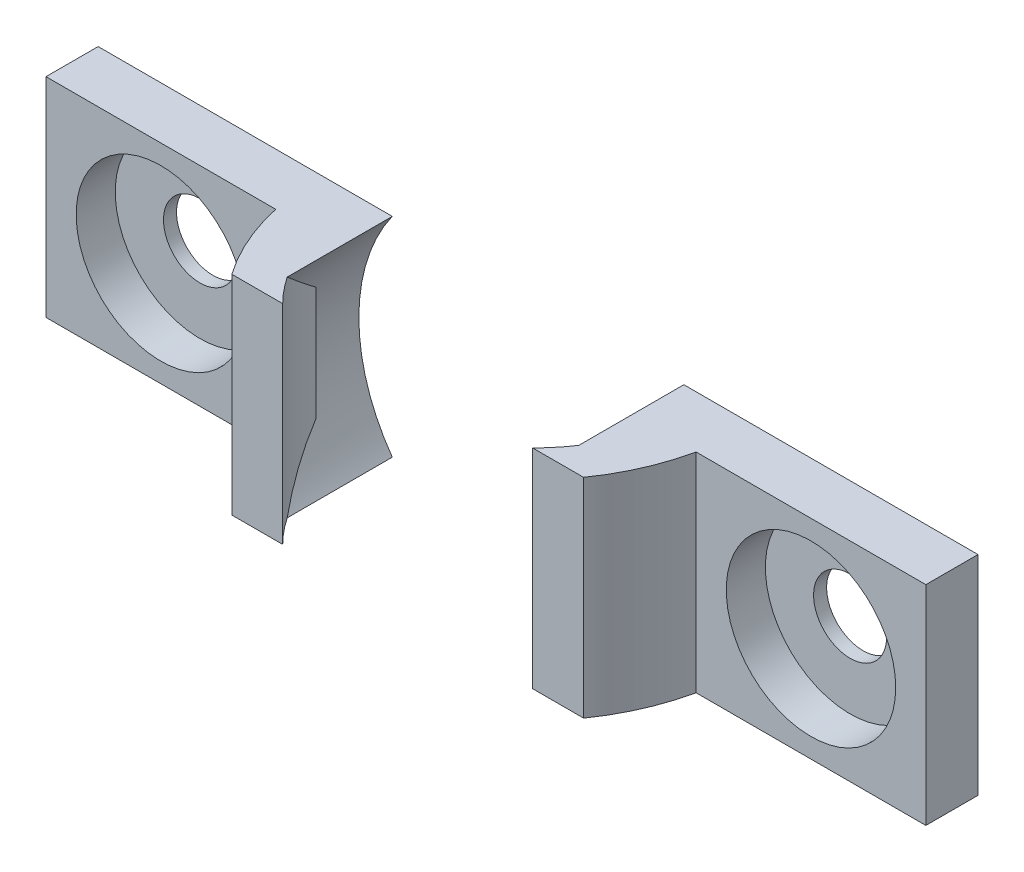
ISO-10303-21;
HEADER;
FILE_DESCRIPTION(('STEP AP214'),'2;1');
FILE_NAME('part.step','',(''),(''),'','','');
FILE_SCHEMA(('AUTOMOTIVE_DESIGN { 1 0 10303 214 1 1 1 1 }'));
ENDSEC;
DATA;
#1=APPLICATION_CONTEXT('core data for automotive mechanical design processes');
#2=APPLICATION_PROTOCOL_DEFINITION('international standard','automotive_design',2000,#1);
#3=PRODUCT_CONTEXT('',#1,'mechanical');
#4=PRODUCT('Part','Part','',(#3));
#5=PRODUCT_RELATED_PRODUCT_CATEGORY('part','',(#4));
#6=PRODUCT_DEFINITION_FORMATION('','',#4);
#7=PRODUCT_DEFINITION_CONTEXT('part definition',#1,'design');
#8=PRODUCT_DEFINITION('design','',#6,#7);
#9=PRODUCT_DEFINITION_SHAPE('','',#8);
#10=(LENGTH_UNIT() NAMED_UNIT(*) SI_UNIT(.MILLI.,.METRE.));
#11=(NAMED_UNIT(*) PLANE_ANGLE_UNIT() SI_UNIT($,.RADIAN.));
#12=(NAMED_UNIT(*) SI_UNIT($,.STERADIAN.) SOLID_ANGLE_UNIT());
#13=UNCERTAINTY_MEASURE_WITH_UNIT(LENGTH_MEASURE(1.E-05),#10,'distance_accuracy_value','');
#14=(GEOMETRIC_REPRESENTATION_CONTEXT(3) GLOBAL_UNCERTAINTY_ASSIGNED_CONTEXT((#13)) GLOBAL_UNIT_ASSIGNED_CONTEXT((#10,
#11,#12)) REPRESENTATION_CONTEXT('',''));
#15=CARTESIAN_POINT('',(0.,0.,0.));
#16=DIRECTION('',(0.,0.,1.));
#17=DIRECTION('',(1.,0.,0.));
#18=AXIS2_PLACEMENT_3D('',#15,#16,#17);
#19=CARTESIAN_POINT('',(-52.019276555044,41.9944163464974,0.250000000000002));
#20=DIRECTION('',(0.,1.,0.));
#21=DIRECTION('',(0.,0.,1.));
#22=AXIS2_PLACEMENT_3D('',#19,#20,#21);
#23=CYLINDRICAL_SURFACE('',#22,6.75);
#24=DIRECTION('',(0.,1.,0.));
#25=VECTOR('',#24,1.);
#26=CARTESIAN_POINT('',(-45.5000741498414,41.9944163464974,2.));
#27=LINE('',#26,#25);
#28=CARTESIAN_POINT('',(-45.5000741498414,43.8113851969259,2.));
#29=VERTEX_POINT('',#28);
#30=CARTESIAN_POINT('',(-45.5000741498414,48.1774474960689,2.));
#31=VERTEX_POINT('',#30);
#32=EDGE_CURVE('E110',#29,#31,#27,.T.);
#33=ORIENTED_EDGE('',*,*,#32,.F.);
#34=CARTESIAN_POINT('',(-46.4277092434578,41.9944163464974,4.03112086556359));
#35=CARTESIAN_POINT('',(-46.3745450771389,42.0687361568406,3.95249636870452));
#36=CARTESIAN_POINT('',(-46.3232633654575,42.1435523845356,3.87309234133147));
#37=CARTESIAN_POINT('',(-46.2243968698751,42.2939969111948,3.71276547153426));
#38=CARTESIAN_POINT('',(-46.1768120889218,42.3696252108065,3.63184262789907));
#39=CARTESIAN_POINT('',(-46.0398947307384,42.5968040836876,3.38755839376506));
#40=CARTESIAN_POINT('',(-45.9559434440079,42.7492906120617,3.2220047005269));
#41=CARTESIAN_POINT('',(-45.8405585930417,42.9783939429114,2.96928504371106));
#42=CARTESIAN_POINT('',(-45.8038517045878,43.0548295451782,2.88430730286349));
#43=CARTESIAN_POINT('',(-45.7339084787982,43.2075141521692,2.71276795793608));
#44=CARTESIAN_POINT('',(-45.7006720041256,43.2837631641607,2.62620641669231));
#45=CARTESIAN_POINT('',(-45.6375101932743,43.436001426688,2.45097382625512));
#46=CARTESIAN_POINT('',(-45.6075992508396,43.5119882660473,2.36229548239488));
#47=CARTESIAN_POINT('',(-45.5512398600187,43.6627539304358,2.18282099136035));
#48=CARTESIAN_POINT('',(-45.5247918071639,43.7375326166161,2.0920246036561));
#49=CARTESIAN_POINT('',(-45.5000741498414,43.8113851969259,2.));
#50=B_SPLINE_CURVE_WITH_KNOTS('',3,(#34,#35,#36,#37,#38,#39,#40,#41,#42,#43,#44,#45,#46,#47,#48,
#49),.UNSPECIFIED.,.F.,.F.,(4,2,2,2,2,2,2,4),(0.,0.361594811071268,0.72318991046974,
1.44327185995061,1.80336518182789,2.16344424812011,2.52502568207447,2.88664837989668),.UNSPECIFIED.);
#51=CARTESIAN_POINT('',(-46.4277092434578,41.9944163464974,4.03112086556359));
#52=VERTEX_POINT('',#51);
#53=EDGE_CURVE('E114',#52,#29,#50,.T.);
#54=ORIENTED_EDGE('',*,*,#53,.F.);
#55=CARTESIAN_POINT('',(-52.019276555044,41.9944163464974,0.250000000000002));
#56=DIRECTION('',(0.,-1.,0.));
#57=DIRECTION('',(0.,0.,-1.));
#58=AXIS2_PLACEMENT_3D('',#55,#56,#57);
#59=CIRCLE('',#58,6.75);
#60=CARTESIAN_POINT('',(-47.2234450317313,41.9944163464974,5.));
#61=VERTEX_POINT('',#60);
#62=EDGE_CURVE('E173',#52,#61,#59,.T.);
#63=ORIENTED_EDGE('',*,*,#62,.T.);
#64=DIRECTION('',(0.,1.,0.));
#65=VECTOR('',#64,1.);
#66=CARTESIAN_POINT('',(-47.2234450317313,41.9944163464974,5.));
#67=LINE('',#66,#65);
#68=CARTESIAN_POINT('',(-47.2234450317313,49.9944163464974,5.));
#69=VERTEX_POINT('',#68);
#70=EDGE_CURVE('E180',#61,#69,#67,.T.);
#71=ORIENTED_EDGE('',*,*,#70,.T.);
#72=CARTESIAN_POINT('',(-52.019276555044,49.9944163464974,0.250000000000002));
#73=DIRECTION('',(0.,-1.,0.));
#74=DIRECTION('',(0.,0.,-1.));
#75=AXIS2_PLACEMENT_3D('',#72,#73,#74);
#76=CIRCLE('',#75,6.75);
#77=CARTESIAN_POINT('',(-46.4277092434578,49.9944163464974,4.03112086556359));
#78=VERTEX_POINT('',#77);
#79=EDGE_CURVE('E112',#78,#69,#76,.T.);
#80=ORIENTED_EDGE('',*,*,#79,.F.);
#81=CARTESIAN_POINT('',(-45.5000741498414,48.1774474960689,2.));
#82=CARTESIAN_POINT('',(-45.5247918071639,48.2513000763787,2.0920246036561));
#83=CARTESIAN_POINT('',(-45.5512398600187,48.326078762559,2.18282099136035));
#84=CARTESIAN_POINT('',(-45.6075992508396,48.4768444269474,2.36229548239488));
#85=CARTESIAN_POINT('',(-45.6375101932743,48.5528312663067,2.45097382625512));
#86=CARTESIAN_POINT('',(-45.7006720041256,48.705069528834,2.62620641669231));
#87=CARTESIAN_POINT('',(-45.7339084787982,48.7813185408256,2.71276795793608));
#88=CARTESIAN_POINT('',(-45.8038517045878,48.9340031478166,2.88430730286349));
#89=CARTESIAN_POINT('',(-45.8405585930417,49.0104387500834,2.96928504371106));
#90=CARTESIAN_POINT('',(-45.9559434440079,49.239542080933,3.2220047005269));
#91=CARTESIAN_POINT('',(-46.0398947307384,49.3920286093072,3.38755839376505));
#92=CARTESIAN_POINT('',(-46.1768120889218,49.6192074821883,3.63184262789907));
#93=CARTESIAN_POINT('',(-46.2243968698751,49.6948357818,3.71276547153425));
#94=CARTESIAN_POINT('',(-46.3232633654575,49.8452803084592,3.87309234133146));
#95=CARTESIAN_POINT('',(-46.3745450771389,49.9200965361541,3.95249636870451));
#96=CARTESIAN_POINT('',(-46.4277092434578,49.9944163464975,4.03112086556355));
#97=B_SPLINE_CURVE_WITH_KNOTS('',3,(#81,#82,#83,#84,#85,#86,#87,#88,#89,#90,#91,#92,#93,#94,#95,
#96),.UNSPECIFIED.,.F.,.F.,(4,2,2,2,2,2,2,4),(0.,0.361622697822208,0.723204131776575,
1.08328319806879,1.44337651994607,2.16345846942693,2.52505356882539,2.88664837989668),.UNSPECIFIED.);
#98=EDGE_CURVE('E108',#31,#78,#97,.T.);
#99=ORIENTED_EDGE('',*,*,#98,.F.);
#100=EDGE_LOOP('',(#33,#54,#63,#71,#80,#99));
#101=FACE_BOUND('',#100,.T.);
#102=ADVANCED_FACE('F44',(#101),#23,.F.);
#103=CARTESIAN_POINT('',(-52.0192765550441,45.9944163464974,2.));
#104=DIRECTION('',(0.,0.,-1.));
#105=DIRECTION('',(-1.,0.,0.));
#106=AXIS2_PLACEMENT_3D('',#103,#104,#105);
#107=CYLINDRICAL_SURFACE('',#106,6.875);
#108=CARTESIAN_POINT('',(-52.0192765550441,45.9944163464974,0.));
#109=DIRECTION('',(0.,0.,1.));
#110=DIRECTION('',(1.,0.,0.));
#111=AXIS2_PLACEMENT_3D('',#108,#109,#110);
#112=CIRCLE('',#111,6.875);
#113=CARTESIAN_POINT('',(-46.4277092434578,41.9944163464974,0.));
#114=VERTEX_POINT('',#113);
#115=CARTESIAN_POINT('',(-46.4277092434578,49.9944163464974,0.));
#116=VERTEX_POINT('',#115);
#117=EDGE_CURVE('E119',#114,#116,#112,.T.);
#118=ORIENTED_EDGE('',*,*,#117,.F.);
#119=DIRECTION('',(0.,0.,-1.));
#120=VECTOR('',#119,1.);
#121=CARTESIAN_POINT('',(-46.4277092434578,41.9944163464974,2.));
#122=LINE('',#121,#120);
#123=EDGE_CURVE('E12',#52,#114,#122,.T.);
#124=ORIENTED_EDGE('',*,*,#123,.F.);
#125=ORIENTED_EDGE('',*,*,#53,.T.);
#126=CARTESIAN_POINT('',(-52.0192765550441,45.9944163464974,2.));
#127=DIRECTION('',(0.,0.,1.));
#128=DIRECTION('',(1.,0.,0.));
#129=AXIS2_PLACEMENT_3D('',#126,#127,#128);
#130=CIRCLE('',#129,6.875);
#131=EDGE_CURVE('E118',#29,#31,#130,.T.);
#132=ORIENTED_EDGE('',*,*,#131,.T.);
#133=ORIENTED_EDGE('',*,*,#98,.T.);
#134=DIRECTION('',(0.,0.,-1.));
#135=VECTOR('',#134,1.);
#136=CARTESIAN_POINT('',(-46.4277092434578,49.9944163464974,2.));
#137=LINE('',#136,#135);
#138=EDGE_CURVE('E65',#78,#116,#137,.T.);
#139=ORIENTED_EDGE('',*,*,#138,.T.);
#140=EDGE_LOOP('',(#118,#124,#125,#132,#133,#139));
#141=FACE_BOUND('',#140,.T.);
#142=ADVANCED_FACE('F46',(#141),#107,.F.);
#143=CARTESIAN_POINT('',(0.,41.9944163464974,2.));
#144=DIRECTION('',(0.,1.,0.));
#145=DIRECTION('',(-1.,0.,0.));
#146=AXIS2_PLACEMENT_3D('',#143,#144,#145);
#147=PLANE('',#146);
#148=ORIENTED_EDGE('',*,*,#62,.F.);
#149=ORIENTED_EDGE('',*,*,#123,.T.);
#150=DIRECTION('',(1.,0.,0.));
#151=VECTOR('',#150,1.);
#152=CARTESIAN_POINT('',(0.,41.9944163464974,0.));
#153=LINE('',#152,#151);
#154=CARTESIAN_POINT('',(-35.1442765550441,41.9944163464974,0.));
#155=VERTEX_POINT('',#154);
#156=EDGE_CURVE('E137',#114,#155,#153,.T.);
#157=ORIENTED_EDGE('',*,*,#156,.T.);
#158=DIRECTION('',(0.,0.,-1.));
#159=VECTOR('',#158,1.);
#160=CARTESIAN_POINT('',(-35.1442765550441,41.9944163464974,2.));
#161=LINE('',#160,#159);
#162=CARTESIAN_POINT('',(-35.1442765550441,41.9944163464974,2.));
#163=VERTEX_POINT('',#162);
#164=EDGE_CURVE('E52',#163,#155,#161,.T.);
#165=ORIENTED_EDGE('',*,*,#164,.F.);
#166=DIRECTION('',(1.,0.,0.));
#167=VECTOR('',#166,1.);
#168=CARTESIAN_POINT('',(0.,41.9944163464974,2.));
#169=LINE('',#168,#167);
#170=CARTESIAN_POINT('',(-43.9570188067455,41.9944163464974,2.));
#171=VERTEX_POINT('',#170);
#172=EDGE_CURVE('E122',#171,#163,#169,.T.);
#173=ORIENTED_EDGE('',*,*,#172,.F.);
#174=CARTESIAN_POINT('',(-52.019276555044,41.9944163464974,0.250000000000002));
#175=DIRECTION('',(0.,-1.,0.));
#176=DIRECTION('',(0.,0.,-1.));
#177=AXIS2_PLACEMENT_3D('',#174,#175,#176);
#178=CIRCLE('',#177,8.25);
#179=CARTESIAN_POINT('',(-45.273907773428,41.9944163464974,5.));
#180=VERTEX_POINT('',#179);
#181=EDGE_CURVE('E167',#171,#180,#178,.T.);
#182=ORIENTED_EDGE('',*,*,#181,.T.);
#183=DIRECTION('',(-1.,0.,0.));
#184=VECTOR('',#183,1.);
#185=CARTESIAN_POINT('',(0.,41.9944163464974,5.00000000000002));
#186=LINE('',#185,#184);
#187=EDGE_CURVE('E170',#180,#61,#186,.T.);
#188=ORIENTED_EDGE('',*,*,#187,.T.);
#189=EDGE_LOOP('',(#148,#149,#157,#165,#173,#182,#188));
#190=FACE_BOUND('',#189,.T.);
#191=ADVANCED_FACE('F165',(#190),#147,.F.);
#192=CARTESIAN_POINT('',(-35.1442765550441,0.,2.));
#193=DIRECTION('',(-1.,0.,0.));
#194=DIRECTION('',(0.,0.,1.));
#195=AXIS2_PLACEMENT_3D('',#192,#193,#194);
#196=PLANE('',#195);
#197=DIRECTION('',(0.,1.,0.));
#198=VECTOR('',#197,1.);
#199=CARTESIAN_POINT('',(-35.1442765550441,0.,0.));
#200=LINE('',#199,#198);
#201=CARTESIAN_POINT('',(-35.1442765550441,49.9944163464974,0.));
#202=VERTEX_POINT('',#201);
#203=EDGE_CURVE('E127',#155,#202,#200,.T.);
#204=ORIENTED_EDGE('',*,*,#203,.T.);
#205=DIRECTION('',(0.,0.,-1.));
#206=VECTOR('',#205,1.);
#207=CARTESIAN_POINT('',(-35.1442765550441,49.9944163464974,2.));
#208=LINE('',#207,#206);
#209=CARTESIAN_POINT('',(-35.1442765550441,49.9944163464974,2.));
#210=VERTEX_POINT('',#209);
#211=EDGE_CURVE('E141',#210,#202,#208,.T.);
#212=ORIENTED_EDGE('',*,*,#211,.F.);
#213=DIRECTION('',(0.,1.,0.));
#214=VECTOR('',#213,1.);
#215=CARTESIAN_POINT('',(-35.1442765550441,0.,2.));
#216=LINE('',#215,#214);
#217=EDGE_CURVE('E125',#163,#210,#216,.T.);
#218=ORIENTED_EDGE('',*,*,#217,.F.);
#219=ORIENTED_EDGE('',*,*,#164,.T.);
#220=EDGE_LOOP('',(#204,#212,#218,#219));
#221=FACE_BOUND('',#220,.T.);
#222=ADVANCED_FACE('F148',(#221),#196,.F.);
#223=CARTESIAN_POINT('',(0.,49.9944163464974,2.));
#224=DIRECTION('',(0.,-1.,0.));
#225=DIRECTION('',(1.,0.,0.));
#226=AXIS2_PLACEMENT_3D('',#223,#224,#225);
#227=PLANE('',#226);
#228=ORIENTED_EDGE('',*,*,#138,.F.);
#229=ORIENTED_EDGE('',*,*,#79,.T.);
#230=DIRECTION('',(-1.,0.,0.));
#231=VECTOR('',#230,1.);
#232=CARTESIAN_POINT('',(0.,49.9944163464974,5.00000000000002));
#233=LINE('',#232,#231);
#234=CARTESIAN_POINT('',(-45.273907773428,49.9944163464974,5.));
#235=VERTEX_POINT('',#234);
#236=EDGE_CURVE('E189',#235,#69,#233,.T.);
#237=ORIENTED_EDGE('',*,*,#236,.F.);
#238=CARTESIAN_POINT('',(-52.019276555044,49.9944163464974,0.250000000000002));
#239=DIRECTION('',(0.,-1.,0.));
#240=DIRECTION('',(0.,0.,-1.));
#241=AXIS2_PLACEMENT_3D('',#238,#239,#240);
#242=CIRCLE('',#241,8.25);
#243=CARTESIAN_POINT('',(-43.9570188067455,49.9944163464974,2.));
#244=VERTEX_POINT('',#243);
#245=EDGE_CURVE('E160',#244,#235,#242,.T.);
#246=ORIENTED_EDGE('',*,*,#245,.F.);
#247=DIRECTION('',(-1.,0.,0.));
#248=VECTOR('',#247,1.);
#249=CARTESIAN_POINT('',(0.,49.9944163464974,2.));
#250=LINE('',#249,#248);
#251=EDGE_CURVE('E132',#210,#244,#250,.T.);
#252=ORIENTED_EDGE('',*,*,#251,.F.);
#253=ORIENTED_EDGE('',*,*,#211,.T.);
#254=DIRECTION('',(-1.,0.,0.));
#255=VECTOR('',#254,1.);
#256=CARTESIAN_POINT('',(0.,49.9944163464974,0.));
#257=LINE('',#256,#255);
#258=EDGE_CURVE('E123',#202,#116,#257,.T.);
#259=ORIENTED_EDGE('',*,*,#258,.T.);
#260=EDGE_LOOP('',(#228,#229,#237,#246,#252,#253,#259));
#261=FACE_BOUND('',#260,.T.);
#262=ADVANCED_FACE('F156',(#261),#227,.F.);
#263=CARTESIAN_POINT('',(0.,0.,2.));
#264=DIRECTION('',(0.,0.,1.));
#265=DIRECTION('',(1.,0.,0.));
#266=AXIS2_PLACEMENT_3D('',#263,#264,#265);
#267=PLANE('',#266);
#268=CARTESIAN_POINT('',(-39.5506476808948,45.9944163464974,2.));
#269=DIRECTION('',(0.,0.,1.));
#270=DIRECTION('',(1.,0.,0.));
#271=AXIS2_PLACEMENT_3D('',#268,#269,#270);
#272=CIRCLE('',#271,3.25);
#273=CARTESIAN_POINT('',(-36.3006476808948,45.9944163464974,2.));
#274=VERTEX_POINT('',#273);
#275=EDGE_CURVE('E333',#274,#274,#272,.T.);
#276=ORIENTED_EDGE('',*,*,#275,.F.);
#277=EDGE_LOOP('',(#276));
#278=FACE_BOUND('',#277,.T.);
#279=DIRECTION('',(0.,1.,0.));
#280=VECTOR('',#279,1.);
#281=CARTESIAN_POINT('',(-43.9570188067455,41.9944163464974,2.));
#282=LINE('',#281,#280);
#283=EDGE_CURVE('E120',#171,#244,#282,.T.);
#284=ORIENTED_EDGE('',*,*,#283,.F.);
#285=ORIENTED_EDGE('',*,*,#172,.T.);
#286=ORIENTED_EDGE('',*,*,#217,.T.);
#287=ORIENTED_EDGE('',*,*,#251,.T.);
#288=EDGE_LOOP('',(#284,#285,#286,#287));
#289=FACE_BOUND('',#288,.T.);
#290=ADVANCED_FACE('F163',(#278,#289),#267,.T.);
#291=CARTESIAN_POINT('',(0.,0.,0.));
#292=DIRECTION('',(0.,0.,1.));
#293=DIRECTION('',(1.,0.,0.));
#294=AXIS2_PLACEMENT_3D('',#291,#292,#293);
#295=PLANE('',#294);
#296=CARTESIAN_POINT('',(-39.5506476808948,45.9944163464974,0.));
#297=DIRECTION('',(0.,0.,1.));
#298=DIRECTION('',(1.,0.,0.));
#299=AXIS2_PLACEMENT_3D('',#296,#297,#298);
#300=CIRCLE('',#299,1.4);
#301=CARTESIAN_POINT('',(-38.1506476808948,45.9944163464974,0.));
#302=VERTEX_POINT('',#301);
#303=EDGE_CURVE('E332',#302,#302,#300,.F.);
#304=ORIENTED_EDGE('',*,*,#303,.F.);
#305=EDGE_LOOP('',(#304));
#306=FACE_BOUND('',#305,.T.);
#307=ORIENTED_EDGE('',*,*,#117,.T.);
#308=ORIENTED_EDGE('',*,*,#258,.F.);
#309=ORIENTED_EDGE('',*,*,#203,.F.);
#310=ORIENTED_EDGE('',*,*,#156,.F.);
#311=EDGE_LOOP('',(#307,#308,#309,#310));
#312=FACE_BOUND('',#311,.T.);
#313=ADVANCED_FACE('F155',(#306,#312),#295,.F.);
#314=CARTESIAN_POINT('',(0.,41.9944163464974,2.00000000000001));
#315=DIRECTION('',(0.,0.,-1.));
#316=DIRECTION('',(-1.,0.,0.));
#317=AXIS2_PLACEMENT_3D('',#314,#315,#316);
#318=PLANE('',#317);
#319=ORIENTED_EDGE('',*,*,#131,.F.);
#320=ORIENTED_EDGE('',*,*,#32,.T.);
#321=EDGE_LOOP('',(#319,#320));
#322=FACE_BOUND('',#321,.T.);
#323=ADVANCED_FACE('F117',(#322),#318,.T.);
#324=CARTESIAN_POINT('',(-52.019276555044,41.9944163464974,0.250000000000002));
#325=DIRECTION('',(0.,1.,0.));
#326=DIRECTION('',(0.,0.,1.));
#327=AXIS2_PLACEMENT_3D('',#324,#325,#326);
#328=CYLINDRICAL_SURFACE('',#327,8.25);
#329=ORIENTED_EDGE('',*,*,#245,.T.);
#330=DIRECTION('',(0.,1.,0.));
#331=VECTOR('',#330,1.);
#332=CARTESIAN_POINT('',(-45.273907773428,41.9944163464974,5.));
#333=LINE('',#332,#331);
#334=EDGE_CURVE('E176',#180,#235,#333,.T.);
#335=ORIENTED_EDGE('',*,*,#334,.F.);
#336=ORIENTED_EDGE('',*,*,#181,.F.);
#337=ORIENTED_EDGE('',*,*,#283,.T.);
#338=EDGE_LOOP('',(#329,#335,#336,#337));
#339=FACE_BOUND('',#338,.T.);
#340=ADVANCED_FACE('F177',(#339),#328,.T.);
#341=CARTESIAN_POINT('',(0.,41.9944163464974,5.00000000000002));
#342=DIRECTION('',(0.,0.,-1.));
#343=DIRECTION('',(-1.,0.,0.));
#344=AXIS2_PLACEMENT_3D('',#341,#342,#343);
#345=PLANE('',#344);
#346=ORIENTED_EDGE('',*,*,#236,.T.);
#347=ORIENTED_EDGE('',*,*,#70,.F.);
#348=ORIENTED_EDGE('',*,*,#187,.F.);
#349=ORIENTED_EDGE('',*,*,#334,.T.);
#350=EDGE_LOOP('',(#346,#347,#348,#349));
#351=FACE_BOUND('',#350,.T.);
#352=ADVANCED_FACE('F182',(#351),#345,.F.);
#353=CARTESIAN_POINT('',(-39.5506476808948,45.9944163464974,0.5));
#354=DIRECTION('',(0.,0.,1.));
#355=DIRECTION('',(1.,0.,0.));
#356=AXIS2_PLACEMENT_3D('',#353,#354,#355);
#357=CYLINDRICAL_SURFACE('',#356,3.25);
#358=CARTESIAN_POINT('',(-39.5506476808948,45.9944163464974,0.5));
#359=DIRECTION('',(0.,0.,1.));
#360=DIRECTION('',(1.,0.,0.));
#361=AXIS2_PLACEMENT_3D('',#358,#359,#360);
#362=CIRCLE('',#361,3.25);
#363=CARTESIAN_POINT('',(-36.3006476808948,45.9944163464974,0.5));
#364=VERTEX_POINT('',#363);
#365=EDGE_CURVE('E336',#364,#364,#362,.T.);
#366=ORIENTED_EDGE('',*,*,#365,.F.);
#367=EDGE_LOOP('',(#366));
#368=FACE_BOUND('',#367,.T.);
#369=ORIENTED_EDGE('',*,*,#275,.T.);
#370=EDGE_LOOP('',(#369));
#371=FACE_BOUND('',#370,.T.);
#372=ADVANCED_FACE('F209',(#368,#371),#357,.F.);
#373=CARTESIAN_POINT('',(-39.5506476808948,45.9944163464974,0.5));
#374=DIRECTION('',(0.,0.,1.));
#375=DIRECTION('',(1.,0.,0.));
#376=AXIS2_PLACEMENT_3D('',#373,#374,#375);
#377=PLANE('',#376);
#378=CARTESIAN_POINT('',(-39.5506476808948,45.9944163464974,0.5));
#379=DIRECTION('',(0.,0.,1.));
#380=DIRECTION('',(1.,0.,0.));
#381=AXIS2_PLACEMENT_3D('',#378,#379,#380);
#382=CIRCLE('',#381,1.4);
#383=CARTESIAN_POINT('',(-38.1506476808948,45.9944163464974,0.5));
#384=VERTEX_POINT('',#383);
#385=EDGE_CURVE('E329',#384,#384,#382,.T.);
#386=ORIENTED_EDGE('',*,*,#385,.F.);
#387=EDGE_LOOP('',(#386));
#388=FACE_BOUND('',#387,.T.);
#389=ORIENTED_EDGE('',*,*,#365,.T.);
#390=EDGE_LOOP('',(#389));
#391=FACE_BOUND('',#390,.T.);
#392=ADVANCED_FACE('F302',(#388,#391),#377,.T.);
#393=CARTESIAN_POINT('',(-39.5506476808948,45.9944163464974,-0.00100000000000002));
#394=DIRECTION('',(0.,0.,1.));
#395=DIRECTION('',(1.,0.,0.));
#396=AXIS2_PLACEMENT_3D('',#393,#394,#395);
#397=CYLINDRICAL_SURFACE('',#396,1.4);
#398=ORIENTED_EDGE('',*,*,#385,.T.);
#399=EDGE_LOOP('',(#398));
#400=FACE_BOUND('',#399,.T.);
#401=ORIENTED_EDGE('',*,*,#303,.T.);
#402=EDGE_LOOP('',(#401));
#403=FACE_BOUND('',#402,.T.);
#404=ADVANCED_FACE('F310',(#400,#403),#397,.F.);
#405=CLOSED_SHELL('',(#102,#142,#191,#222,#262,#290,#313,#323,#340,#352,#372,#392,#404));
#406=MANIFOLD_SOLID_BREP('B2',#405);
#407=CARTESIAN_POINT('',(-52.019276555044,41.9944163464974,0.250000000000002));
#408=DIRECTION('',(0.,1.,0.));
#409=DIRECTION('',(0.,0.,1.));
#410=AXIS2_PLACEMENT_3D('',#407,#408,#409);
#411=CYLINDRICAL_SURFACE('',#410,6.75);
#412=CARTESIAN_POINT('',(-52.019276555044,41.9944163464974,0.250000000000002));
#413=DIRECTION('',(0.,-1.,0.));
#414=DIRECTION('',(0.,0.,-1.));
#415=AXIS2_PLACEMENT_3D('',#412,#413,#414);
#416=CIRCLE('',#415,6.75);
#417=CARTESIAN_POINT('',(-56.8151080783567,41.9944163464974,5.));
#418=VERTEX_POINT('',#417);
#419=CARTESIAN_POINT('',(-57.6108438666303,41.9944163464974,4.03112086556351));
#420=VERTEX_POINT('',#419);
#421=EDGE_CURVE('E425',#418,#420,#416,.T.);
#422=ORIENTED_EDGE('',*,*,#421,.T.);
#423=CARTESIAN_POINT('',(-58.5384789602467,43.8113851969257,2.));
#424=CARTESIAN_POINT('',(-58.5137613029242,43.7375326166159,2.09202460365609));
#425=CARTESIAN_POINT('',(-58.4873132500693,43.6627539304356,2.18282099136034));
#426=CARTESIAN_POINT('',(-58.4309538592485,43.5119882660472,2.36229548239487));
#427=CARTESIAN_POINT('',(-58.4010429168137,43.4360014266879,2.4509738262551));
#428=CARTESIAN_POINT('',(-58.3378811059624,43.2837631641606,2.62620641669229));
#429=CARTESIAN_POINT('',(-58.3046446312899,43.2075141521691,2.71276795793605));
#430=CARTESIAN_POINT('',(-58.2347014055002,43.0548295451781,2.88430730286345));
#431=CARTESIAN_POINT('',(-58.1979945170464,42.9783939429113,2.96928504371102));
#432=CARTESIAN_POINT('',(-58.0826096660802,42.7492906120617,3.22200470052685));
#433=CARTESIAN_POINT('',(-57.9986583793497,42.5968040836875,3.38755839376499));
#434=CARTESIAN_POINT('',(-57.8617410211662,42.3696252108064,3.631842627899));
#435=CARTESIAN_POINT('',(-57.814156240213,42.2939969111948,3.71276547153418));
#436=CARTESIAN_POINT('',(-57.7152897446306,42.1435523845356,3.87309234133138));
#437=CARTESIAN_POINT('',(-57.6640080329492,42.0687361568406,3.95249636870442));
#438=CARTESIAN_POINT('',(-57.6108438666303,41.9944163464973,4.03112086556346));
#439=B_SPLINE_CURVE_WITH_KNOTS('',3,(#423,#424,#425,#426,#427,#428,#429,#430,#431,#432,#433,
#434,#435,#436,#437,#438),.UNSPECIFIED.,.F.,.F.,(4,2,2,2,2,2,2,4),(0.,0.361622697822184,
0.723204131776527,1.08328319806871,1.44337651994597,2.16345846942679,2.52505356882524,
2.88664837989648),.UNSPECIFIED.);
#440=CARTESIAN_POINT('',(-58.5384789602467,43.8113851969257,2.));
#441=VERTEX_POINT('',#440);
#442=EDGE_CURVE('E434',#441,#420,#439,.T.);
#443=ORIENTED_EDGE('',*,*,#442,.F.);
#444=DIRECTION('',(0.,1.,0.));
#445=VECTOR('',#444,1.);
#446=CARTESIAN_POINT('',(-58.5384789602467,41.9944163464974,2.));
#447=LINE('',#446,#445);
#448=CARTESIAN_POINT('',(-58.5384789602467,48.1774474960691,2.));
#449=VERTEX_POINT('',#448);
#450=EDGE_CURVE('E460',#441,#449,#447,.T.);
#451=ORIENTED_EDGE('',*,*,#450,.T.);
#452=CARTESIAN_POINT('',(-57.6108438666303,49.9944163464974,4.03112086556351));
#453=CARTESIAN_POINT('',(-57.6640080329492,49.9200965361541,3.95249636870444));
#454=CARTESIAN_POINT('',(-57.7152897446305,49.8452803084592,3.8730923413314));
#455=CARTESIAN_POINT('',(-57.814156240213,49.6948357818,3.71276547153419));
#456=CARTESIAN_POINT('',(-57.8617410211662,49.6192074821883,3.63184262789901));
#457=CARTESIAN_POINT('',(-57.9986583793497,49.3920286093073,3.387558393765));
#458=CARTESIAN_POINT('',(-58.0826096660802,49.2395420809331,3.22200470052686));
#459=CARTESIAN_POINT('',(-58.1979945170464,49.0104387500835,2.96928504371102));
#460=CARTESIAN_POINT('',(-58.2347014055002,48.9340031478167,2.88430730286346));
#461=CARTESIAN_POINT('',(-58.3046446312899,48.7813185408257,2.71276795793606));
#462=CARTESIAN_POINT('',(-58.3378811059624,48.7050695288342,2.6262064166923));
#463=CARTESIAN_POINT('',(-58.4010429168137,48.5528312663069,2.45097382625511));
#464=CARTESIAN_POINT('',(-58.4309538592485,48.4768444269476,2.36229548239487));
#465=CARTESIAN_POINT('',(-58.4873132500693,48.3260787625591,2.18282099136034));
#466=CARTESIAN_POINT('',(-58.5137613029242,48.2513000763788,2.09202460365609));
#467=CARTESIAN_POINT('',(-58.5384789602467,48.1774474960691,2.));
#468=B_SPLINE_CURVE_WITH_KNOTS('',3,(#452,#453,#454,#455,#456,#457,#458,#459,#460,#461,#462,
#463,#464,#465,#466,#467),.UNSPECIFIED.,.F.,.F.,(4,2,2,2,2,2,2,4),(0.,0.361594811071247,
0.7231899104697,1.44327185995052,1.80336518182776,2.16344424811996,2.52502568207431,
2.8866483798965),.UNSPECIFIED.);
#469=CARTESIAN_POINT('',(-57.6108438666303,49.9944163464974,4.03112086556351));
#470=VERTEX_POINT('',#469);
#471=EDGE_CURVE('E440',#470,#449,#468,.T.);
#472=ORIENTED_EDGE('',*,*,#471,.F.);
#473=CARTESIAN_POINT('',(-52.019276555044,49.9944163464974,0.250000000000002));
#474=DIRECTION('',(0.,-1.,0.));
#475=DIRECTION('',(0.,0.,-1.));
#476=AXIS2_PLACEMENT_3D('',#473,#474,#475);
#477=CIRCLE('',#476,6.75);
#478=CARTESIAN_POINT('',(-56.8151080783567,49.9944163464974,5.));
#479=VERTEX_POINT('',#478);
#480=EDGE_CURVE('E461',#479,#470,#477,.T.);
#481=ORIENTED_EDGE('',*,*,#480,.F.);
#482=DIRECTION('',(0.,1.,0.));
#483=VECTOR('',#482,1.);
#484=CARTESIAN_POINT('',(-56.8151080783567,41.9944163464974,5.));
#485=LINE('',#484,#483);
#486=EDGE_CURVE('E444',#418,#479,#485,.T.);
#487=ORIENTED_EDGE('',*,*,#486,.F.);
#488=EDGE_LOOP('',(#422,#443,#451,#472,#481,#487));
#489=FACE_BOUND('',#488,.T.);
#490=ADVANCED_FACE('F356',(#489),#411,.F.);
#491=CARTESIAN_POINT('',(0.,0.,2.));
#492=DIRECTION('',(0.,0.,1.));
#493=DIRECTION('',(1.,0.,0.));
#494=AXIS2_PLACEMENT_3D('',#491,#492,#493);
#495=PLANE('',#494);
#496=CARTESIAN_POINT('',(-64.4879054291933,45.9944163464974,2.));
#497=DIRECTION('',(0.,0.,1.));
#498=DIRECTION('',(1.,0.,0.));
#499=AXIS2_PLACEMENT_3D('',#496,#497,#498);
#500=CIRCLE('',#499,3.25);
#501=CARTESIAN_POINT('',(-61.2379054291933,45.9944163464974,2.));
#502=VERTEX_POINT('',#501);
#503=EDGE_CURVE('E540',#502,#502,#500,.T.);
#504=ORIENTED_EDGE('',*,*,#503,.F.);
#505=EDGE_LOOP('',(#504));
#506=FACE_BOUND('',#505,.T.);
#507=DIRECTION('',(-1.,0.,0.));
#508=VECTOR('',#507,1.);
#509=CARTESIAN_POINT('',(0.,41.9944163464974,2.));
#510=LINE('',#509,#508);
#511=CARTESIAN_POINT('',(-60.0815343033426,41.9944163464974,2.));
#512=VERTEX_POINT('',#511);
#513=CARTESIAN_POINT('',(-68.894276555044,41.9944163464974,2.));
#514=VERTEX_POINT('',#513);
#515=EDGE_CURVE('E431',#512,#514,#510,.T.);
#516=ORIENTED_EDGE('',*,*,#515,.F.);
#517=DIRECTION('',(0.,1.,0.));
#518=VECTOR('',#517,1.);
#519=CARTESIAN_POINT('',(-60.0815343033426,41.9944163464974,2.));
#520=LINE('',#519,#518);
#521=CARTESIAN_POINT('',(-60.0815343033426,49.9944163464974,2.));
#522=VERTEX_POINT('',#521);
#523=EDGE_CURVE('E467',#512,#522,#520,.T.);
#524=ORIENTED_EDGE('',*,*,#523,.T.);
#525=DIRECTION('',(1.,0.,0.));
#526=VECTOR('',#525,1.);
#527=CARTESIAN_POINT('',(0.,49.9944163464974,2.));
#528=LINE('',#527,#526);
#529=CARTESIAN_POINT('',(-68.894276555044,49.9944163464974,2.));
#530=VERTEX_POINT('',#529);
#531=EDGE_CURVE('E474',#530,#522,#528,.T.);
#532=ORIENTED_EDGE('',*,*,#531,.F.);
#533=DIRECTION('',(0.,1.,0.));
#534=VECTOR('',#533,1.);
#535=CARTESIAN_POINT('',(-68.894276555044,0.,2.));
#536=LINE('',#535,#534);
#537=EDGE_CURVE('E477',#514,#530,#536,.T.);
#538=ORIENTED_EDGE('',*,*,#537,.F.);
#539=EDGE_LOOP('',(#516,#524,#532,#538));
#540=FACE_BOUND('',#539,.T.);
#541=ADVANCED_FACE('F515',(#506,#540),#495,.T.);
#542=CARTESIAN_POINT('',(-52.0192765550441,45.9944163464974,2.));
#543=DIRECTION('',(0.,0.,-1.));
#544=DIRECTION('',(-1.,0.,0.));
#545=AXIS2_PLACEMENT_3D('',#542,#543,#544);
#546=CYLINDRICAL_SURFACE('',#545,6.875);
#547=CARTESIAN_POINT('',(-52.0192765550441,45.9944163464974,0.));
#548=DIRECTION('',(0.,0.,1.));
#549=DIRECTION('',(1.,0.,0.));
#550=AXIS2_PLACEMENT_3D('',#547,#548,#549);
#551=CIRCLE('',#550,6.875);
#552=CARTESIAN_POINT('',(-57.6108438666303,49.9944163464974,0.));
#553=VERTEX_POINT('',#552);
#554=CARTESIAN_POINT('',(-57.6108438666303,41.9944163464974,0.));
#555=VERTEX_POINT('',#554);
#556=EDGE_CURVE('E472',#553,#555,#551,.T.);
#557=ORIENTED_EDGE('',*,*,#556,.F.);
#558=DIRECTION('',(0.,0.,-1.));
#559=VECTOR('',#558,1.);
#560=CARTESIAN_POINT('',(-57.6108438666303,49.9944163464974,2.));
#561=LINE('',#560,#559);
#562=EDGE_CURVE('E42',#470,#553,#561,.T.);
#563=ORIENTED_EDGE('',*,*,#562,.F.);
#564=ORIENTED_EDGE('',*,*,#471,.T.);
#565=CARTESIAN_POINT('',(-52.0192765550441,45.9944163464974,2.));
#566=DIRECTION('',(0.,0.,1.));
#567=DIRECTION('',(1.,0.,0.));
#568=AXIS2_PLACEMENT_3D('',#565,#566,#567);
#569=CIRCLE('',#568,6.875);
#570=EDGE_CURVE('E436',#449,#441,#569,.T.);
#571=ORIENTED_EDGE('',*,*,#570,.T.);
#572=ORIENTED_EDGE('',*,*,#442,.T.);
#573=DIRECTION('',(0.,0.,-1.));
#574=VECTOR('',#573,1.);
#575=CARTESIAN_POINT('',(-57.6108438666303,41.9944163464974,2.));
#576=LINE('',#575,#574);
#577=EDGE_CURVE('E420',#420,#555,#576,.T.);
#578=ORIENTED_EDGE('',*,*,#577,.T.);
#579=EDGE_LOOP('',(#557,#563,#564,#571,#572,#578));
#580=FACE_BOUND('',#579,.T.);
#581=ADVANCED_FACE('F358',(#580),#546,.F.);
#582=CARTESIAN_POINT('',(0.,49.9944163464974,2.));
#583=DIRECTION('',(0.,1.,0.));
#584=DIRECTION('',(0.,0.,1.));
#585=AXIS2_PLACEMENT_3D('',#582,#583,#584);
#586=PLANE('',#585);
#587=ORIENTED_EDGE('',*,*,#480,.T.);
#588=ORIENTED_EDGE('',*,*,#562,.T.);
#589=DIRECTION('',(1.,0.,0.));
#590=VECTOR('',#589,1.);
#591=CARTESIAN_POINT('',(0.,49.9944163464974,0.));
#592=LINE('',#591,#590);
#593=CARTESIAN_POINT('',(-68.894276555044,49.9944163464974,0.));
#594=VERTEX_POINT('',#593);
#595=EDGE_CURVE('E482',#594,#553,#592,.T.);
#596=ORIENTED_EDGE('',*,*,#595,.F.);
#597=DIRECTION('',(0.,0.,-1.));
#598=VECTOR('',#597,1.);
#599=CARTESIAN_POINT('',(-68.894276555044,49.9944163464974,2.));
#600=LINE('',#599,#598);
#601=EDGE_CURVE('E364',#530,#594,#600,.T.);
#602=ORIENTED_EDGE('',*,*,#601,.F.);
#603=ORIENTED_EDGE('',*,*,#531,.T.);
#604=CARTESIAN_POINT('',(-52.019276555044,49.9944163464974,0.250000000000002));
#605=DIRECTION('',(0.,-1.,0.));
#606=DIRECTION('',(0.,0.,-1.));
#607=AXIS2_PLACEMENT_3D('',#604,#605,#606);
#608=CIRCLE('',#607,8.25);
#609=CARTESIAN_POINT('',(-58.76464533666,49.9944163464974,5.));
#610=VERTEX_POINT('',#609);
#611=EDGE_CURVE('E377',#610,#522,#608,.T.);
#612=ORIENTED_EDGE('',*,*,#611,.F.);
#613=DIRECTION('',(1.,0.,0.));
#614=VECTOR('',#613,1.);
#615=CARTESIAN_POINT('',(0.,49.9944163464974,5.));
#616=LINE('',#615,#614);
#617=EDGE_CURVE('E449',#610,#479,#616,.T.);
#618=ORIENTED_EDGE('',*,*,#617,.T.);
#619=EDGE_LOOP('',(#587,#588,#596,#602,#603,#612,#618));
#620=FACE_BOUND('',#619,.T.);
#621=ADVANCED_FACE('F497',(#620),#586,.T.);
#622=CARTESIAN_POINT('',(-68.894276555044,0.,2.));
#623=DIRECTION('',(-1.,0.,0.));
#624=DIRECTION('',(0.,0.,1.));
#625=AXIS2_PLACEMENT_3D('',#622,#623,#624);
#626=PLANE('',#625);
#627=DIRECTION('',(0.,1.,0.));
#628=VECTOR('',#627,1.);
#629=CARTESIAN_POINT('',(-68.894276555044,0.,0.));
#630=LINE('',#629,#628);
#631=CARTESIAN_POINT('',(-68.894276555044,41.9944163464974,0.));
#632=VERTEX_POINT('',#631);
#633=EDGE_CURVE('E485',#632,#594,#630,.T.);
#634=ORIENTED_EDGE('',*,*,#633,.F.);
#635=DIRECTION('',(0.,0.,-1.));
#636=VECTOR('',#635,1.);
#637=CARTESIAN_POINT('',(-68.894276555044,41.9944163464974,2.));
#638=LINE('',#637,#636);
#639=EDGE_CURVE('E430',#514,#632,#638,.T.);
#640=ORIENTED_EDGE('',*,*,#639,.F.);
#641=ORIENTED_EDGE('',*,*,#537,.T.);
#642=ORIENTED_EDGE('',*,*,#601,.T.);
#643=EDGE_LOOP('',(#634,#640,#641,#642));
#644=FACE_BOUND('',#643,.T.);
#645=ADVANCED_FACE('F492',(#644),#626,.T.);
#646=CARTESIAN_POINT('',(0.,41.9944163464974,2.));
#647=DIRECTION('',(0.,-1.,0.));
#648=DIRECTION('',(0.,0.,-1.));
#649=AXIS2_PLACEMENT_3D('',#646,#647,#648);
#650=PLANE('',#649);
#651=DIRECTION('',(-1.,0.,0.));
#652=VECTOR('',#651,1.);
#653=CARTESIAN_POINT('',(0.,41.9944163464974,0.));
#654=LINE('',#653,#652);
#655=EDGE_CURVE('E428',#555,#632,#654,.T.);
#656=ORIENTED_EDGE('',*,*,#655,.F.);
#657=ORIENTED_EDGE('',*,*,#577,.F.);
#658=ORIENTED_EDGE('',*,*,#421,.F.);
#659=DIRECTION('',(1.,0.,0.));
#660=VECTOR('',#659,1.);
#661=CARTESIAN_POINT('',(0.,41.9944163464974,5.));
#662=LINE('',#661,#660);
#663=CARTESIAN_POINT('',(-58.76464533666,41.9944163464974,5.));
#664=VERTEX_POINT('',#663);
#665=EDGE_CURVE('E445',#664,#418,#662,.T.);
#666=ORIENTED_EDGE('',*,*,#665,.F.);
#667=CARTESIAN_POINT('',(-52.019276555044,41.9944163464974,0.250000000000002));
#668=DIRECTION('',(0.,-1.,0.));
#669=DIRECTION('',(0.,0.,-1.));
#670=AXIS2_PLACEMENT_3D('',#667,#668,#669);
#671=CIRCLE('',#670,8.25);
#672=EDGE_CURVE('E447',#664,#512,#671,.T.);
#673=ORIENTED_EDGE('',*,*,#672,.T.);
#674=ORIENTED_EDGE('',*,*,#515,.T.);
#675=ORIENTED_EDGE('',*,*,#639,.T.);
#676=EDGE_LOOP('',(#656,#657,#658,#666,#673,#674,#675));
#677=FACE_BOUND('',#676,.T.);
#678=ADVANCED_FACE('F422',(#677),#650,.T.);
#679=CARTESIAN_POINT('',(0.,0.,0.));
#680=DIRECTION('',(0.,0.,1.));
#681=DIRECTION('',(1.,0.,0.));
#682=AXIS2_PLACEMENT_3D('',#679,#680,#681);
#683=PLANE('',#682);
#684=CARTESIAN_POINT('',(-64.4879054291933,45.9944163464974,0.));
#685=DIRECTION('',(0.,0.,1.));
#686=DIRECTION('',(1.,0.,0.));
#687=AXIS2_PLACEMENT_3D('',#684,#685,#686);
#688=CIRCLE('',#687,1.4);
#689=CARTESIAN_POINT('',(-63.0879054291933,45.9944163464974,0.));
#690=VERTEX_POINT('',#689);
#691=EDGE_CURVE('E543',#690,#690,#688,.F.);
#692=ORIENTED_EDGE('',*,*,#691,.F.);
#693=EDGE_LOOP('',(#692));
#694=FACE_BOUND('',#693,.T.);
#695=ORIENTED_EDGE('',*,*,#556,.T.);
#696=ORIENTED_EDGE('',*,*,#655,.T.);
#697=ORIENTED_EDGE('',*,*,#633,.T.);
#698=ORIENTED_EDGE('',*,*,#595,.T.);
#699=EDGE_LOOP('',(#695,#696,#697,#698));
#700=FACE_BOUND('',#699,.T.);
#701=ADVANCED_FACE('F499',(#694,#700),#683,.F.);
#702=CARTESIAN_POINT('',(0.,41.9944163464974,5.));
#703=DIRECTION('',(0.,0.,1.));
#704=DIRECTION('',(1.,0.,0.));
#705=AXIS2_PLACEMENT_3D('',#702,#703,#704);
#706=PLANE('',#705);
#707=ORIENTED_EDGE('',*,*,#617,.F.);
#708=DIRECTION('',(0.,1.,0.));
#709=VECTOR('',#708,1.);
#710=CARTESIAN_POINT('',(-58.76464533666,41.9944163464974,5.));
#711=LINE('',#710,#709);
#712=EDGE_CURVE('E469',#664,#610,#711,.T.);
#713=ORIENTED_EDGE('',*,*,#712,.F.);
#714=ORIENTED_EDGE('',*,*,#665,.T.);
#715=ORIENTED_EDGE('',*,*,#486,.T.);
#716=EDGE_LOOP('',(#707,#713,#714,#715));
#717=FACE_BOUND('',#716,.T.);
#718=ADVANCED_FACE('F501',(#717),#706,.T.);
#719=CARTESIAN_POINT('',(-52.019276555044,41.9944163464974,0.250000000000002));
#720=DIRECTION('',(0.,1.,0.));
#721=DIRECTION('',(0.,0.,1.));
#722=AXIS2_PLACEMENT_3D('',#719,#720,#721);
#723=CYLINDRICAL_SURFACE('',#722,8.25);
#724=ORIENTED_EDGE('',*,*,#611,.T.);
#725=ORIENTED_EDGE('',*,*,#523,.F.);
#726=ORIENTED_EDGE('',*,*,#672,.F.);
#727=ORIENTED_EDGE('',*,*,#712,.T.);
#728=EDGE_LOOP('',(#724,#725,#726,#727));
#729=FACE_BOUND('',#728,.T.);
#730=ADVANCED_FACE('F508',(#729),#723,.T.);
#731=CARTESIAN_POINT('',(0.,41.9944163464974,2.));
#732=DIRECTION('',(0.,0.,1.));
#733=DIRECTION('',(1.,0.,0.));
#734=AXIS2_PLACEMENT_3D('',#731,#732,#733);
#735=PLANE('',#734);
#736=ORIENTED_EDGE('',*,*,#570,.F.);
#737=ORIENTED_EDGE('',*,*,#450,.F.);
#738=EDGE_LOOP('',(#736,#737));
#739=FACE_BOUND('',#738,.T.);
#740=ADVANCED_FACE('F524',(#739),#735,.F.);
#741=CARTESIAN_POINT('',(-64.4879054291933,45.9944163464974,0.5));
#742=DIRECTION('',(0.,0.,1.));
#743=DIRECTION('',(1.,0.,0.));
#744=AXIS2_PLACEMENT_3D('',#741,#742,#743);
#745=CYLINDRICAL_SURFACE('',#744,3.25);
#746=CARTESIAN_POINT('',(-64.4879054291933,45.9944163464974,0.5));
#747=DIRECTION('',(0.,0.,1.));
#748=DIRECTION('',(1.,0.,0.));
#749=AXIS2_PLACEMENT_3D('',#746,#747,#748);
#750=CIRCLE('',#749,3.25);
#751=CARTESIAN_POINT('',(-61.2379054291933,45.9944163464974,0.5));
#752=VERTEX_POINT('',#751);
#753=EDGE_CURVE('E441',#752,#752,#750,.T.);
#754=ORIENTED_EDGE('',*,*,#753,.F.);
#755=EDGE_LOOP('',(#754));
#756=FACE_BOUND('',#755,.T.);
#757=ORIENTED_EDGE('',*,*,#503,.T.);
#758=EDGE_LOOP('',(#757));
#759=FACE_BOUND('',#758,.T.);
#760=ADVANCED_FACE('F526',(#756,#759),#745,.F.);
#761=CARTESIAN_POINT('',(-64.4879054291933,45.9944163464974,0.5));
#762=DIRECTION('',(0.,0.,1.));
#763=DIRECTION('',(1.,0.,0.));
#764=AXIS2_PLACEMENT_3D('',#761,#762,#763);
#765=PLANE('',#764);
#766=CARTESIAN_POINT('',(-64.4879054291933,45.9944163464974,0.5));
#767=DIRECTION('',(0.,0.,1.));
#768=DIRECTION('',(1.,0.,0.));
#769=AXIS2_PLACEMENT_3D('',#766,#767,#768);
#770=CIRCLE('',#769,1.4);
#771=CARTESIAN_POINT('',(-63.0879054291933,45.9944163464974,0.5));
#772=VERTEX_POINT('',#771);
#773=EDGE_CURVE('E548',#772,#772,#770,.T.);
#774=ORIENTED_EDGE('',*,*,#773,.F.);
#775=EDGE_LOOP('',(#774));
#776=FACE_BOUND('',#775,.T.);
#777=ORIENTED_EDGE('',*,*,#753,.T.);
#778=EDGE_LOOP('',(#777));
#779=FACE_BOUND('',#778,.T.);
#780=ADVANCED_FACE('F555',(#776,#779),#765,.T.);
#781=CARTESIAN_POINT('',(-64.4879054291933,45.9944163464974,-0.00100000000000002));
#782=DIRECTION('',(0.,0.,1.));
#783=DIRECTION('',(1.,0.,0.));
#784=AXIS2_PLACEMENT_3D('',#781,#782,#783);
#785=CYLINDRICAL_SURFACE('',#784,1.4);
#786=ORIENTED_EDGE('',*,*,#773,.T.);
#787=EDGE_LOOP('',(#786));
#788=FACE_BOUND('',#787,.T.);
#789=ORIENTED_EDGE('',*,*,#691,.T.);
#790=EDGE_LOOP('',(#789));
#791=FACE_BOUND('',#790,.T.);
#792=ADVANCED_FACE('F552',(#788,#791),#785,.F.);
#793=CLOSED_SHELL('',(#490,#541,#581,#621,#645,#678,#701,#718,#730,#740,#760,#780,#792));
#794=MANIFOLD_SOLID_BREP('B6',#793);
#795=ADVANCED_BREP_SHAPE_REPRESENTATION('',(#18,#406,#794),#14);
#796=SHAPE_DEFINITION_REPRESENTATION(#9,#795);
ENDSEC;
END-ISO-10303-21;
